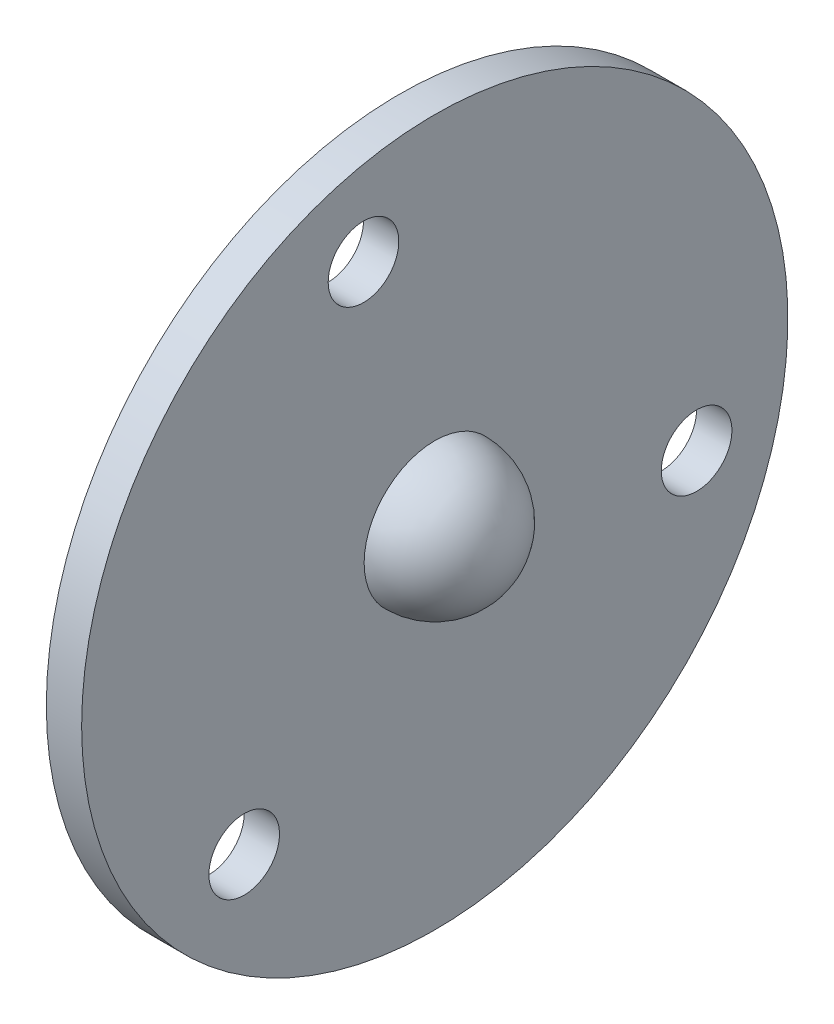
ISO-10303-21;
HEADER;
FILE_DESCRIPTION(('STEP AP214'),'2;1');
FILE_NAME('part.step','',(''),(''),'','','');
FILE_SCHEMA(('AUTOMOTIVE_DESIGN { 1 0 10303 214 1 1 1 1 }'));
ENDSEC;
DATA;
#1=APPLICATION_CONTEXT('core data for automotive mechanical design processes');
#2=APPLICATION_PROTOCOL_DEFINITION('international standard','automotive_design',2000,#1);
#3=PRODUCT_CONTEXT('',#1,'mechanical');
#4=PRODUCT('Part','Part','',(#3));
#5=PRODUCT_RELATED_PRODUCT_CATEGORY('part','',(#4));
#6=PRODUCT_DEFINITION_FORMATION('','',#4);
#7=PRODUCT_DEFINITION_CONTEXT('part definition',#1,'design');
#8=PRODUCT_DEFINITION('design','',#6,#7);
#9=PRODUCT_DEFINITION_SHAPE('','',#8);
#10=(LENGTH_UNIT() NAMED_UNIT(*) SI_UNIT(.MILLI.,.METRE.));
#11=(NAMED_UNIT(*) PLANE_ANGLE_UNIT() SI_UNIT($,.RADIAN.));
#12=(NAMED_UNIT(*) SI_UNIT($,.STERADIAN.) SOLID_ANGLE_UNIT());
#13=UNCERTAINTY_MEASURE_WITH_UNIT(LENGTH_MEASURE(1.E-05),#10,'distance_accuracy_value','');
#14=(GEOMETRIC_REPRESENTATION_CONTEXT(3) GLOBAL_UNCERTAINTY_ASSIGNED_CONTEXT((#13)) GLOBAL_UNIT_ASSIGNED_CONTEXT((#10,
#11,#12)) REPRESENTATION_CONTEXT('',''));
#15=CARTESIAN_POINT('',(0.,0.,0.));
#16=DIRECTION('',(0.,0.,1.));
#17=DIRECTION('',(1.,0.,0.));
#18=AXIS2_PLACEMENT_3D('',#15,#16,#17);
#19=CARTESIAN_POINT('',(-27.1963253808566,0.,0.));
#20=DIRECTION('',(-1.,0.,0.));
#21=DIRECTION('',(0.,0.,-1.));
#22=AXIS2_PLACEMENT_3D('',#19,#20,#21);
#23=SPHERICAL_SURFACE('',#22,11.);
#24=CARTESIAN_POINT('',(-27.1963253808566,0.,0.));
#25=DIRECTION('',(-1.,0.,0.));
#26=DIRECTION('',(0.,0.,1.));
#27=AXIS2_PLACEMENT_3D('',#24,#25,#26);
#28=CIRCLE('',#27,11.);
#29=CARTESIAN_POINT('',(-27.1963253808566,0.,11.));
#30=VERTEX_POINT('',#29);
#31=EDGE_CURVE('E10',#30,#30,#28,.T.);
#32=ORIENTED_EDGE('',*,*,#31,.T.);
#33=EDGE_LOOP('',(#32));
#34=FACE_BOUND('',#33,.T.);
#35=ADVANCED_FACE('F30',(#34),#23,.T.);
#36=CARTESIAN_POINT('',(-27.1963253808566,0.,-30.));
#37=DIRECTION('',(1.,0.,0.));
#38=DIRECTION('',(0.,0.,-1.));
#39=AXIS2_PLACEMENT_3D('',#36,#37,#38);
#40=PLANE('',#39);
#41=CARTESIAN_POINT('',(-27.1963253808566,22.1888707263924,6.05425601436278));
#42=DIRECTION('',(-1.,0.,0.));
#43=DIRECTION('',(0.,-0.866025403784443,-0.499999999999992));
#44=AXIS2_PLACEMENT_3D('',#41,#42,#43);
#45=CIRCLE('',#44,3.);
#46=CARTESIAN_POINT('',(-27.1963253808566,19.590794515039,4.5542560143628));
#47=VERTEX_POINT('',#46);
#48=EDGE_CURVE('E62',#47,#47,#45,.T.);
#49=ORIENTED_EDGE('',*,*,#48,.F.);
#50=EDGE_LOOP('',(#49));
#51=FACE_BOUND('',#50,.T.);
#52=CARTESIAN_POINT('',(-27.1963253808566,-16.3375748726492,16.1889977231632));
#53=DIRECTION('',(-1.,0.,0.));
#54=DIRECTION('',(0.,0.866025403784436,-0.500000000000004));
#55=AXIS2_PLACEMENT_3D('',#52,#53,#54);
#56=CIRCLE('',#55,3.);
#57=CARTESIAN_POINT('',(-27.1963253808566,-13.7394986612958,14.6889977231632));
#58=VERTEX_POINT('',#57);
#59=EDGE_CURVE('E52',#58,#58,#56,.T.);
#60=ORIENTED_EDGE('',*,*,#59,.F.);
#61=EDGE_LOOP('',(#60));
#62=FACE_BOUND('',#61,.T.);
#63=CARTESIAN_POINT('',(-27.1963253808566,-5.85129585374309,-22.2432537375261));
#64=DIRECTION('',(-1.,0.,0.));
#65=DIRECTION('',(0.,0.,1.));
#66=AXIS2_PLACEMENT_3D('',#63,#64,#65);
#67=CIRCLE('',#66,3.);
#68=CARTESIAN_POINT('',(-27.1963253808566,-5.85129585374309,-19.2432537375261));
#69=VERTEX_POINT('',#68);
#70=EDGE_CURVE('E49',#69,#69,#67,.T.);
#71=ORIENTED_EDGE('',*,*,#70,.F.);
#72=EDGE_LOOP('',(#71));
#73=FACE_BOUND('',#72,.T.);
#74=ORIENTED_EDGE('',*,*,#31,.F.);
#75=EDGE_LOOP('',(#74));
#76=FACE_BOUND('',#75,.T.);
#77=CARTESIAN_POINT('',(-27.1963253808566,0.,0.));
#78=DIRECTION('',(-1.,0.,0.));
#79=DIRECTION('',(0.,0.,1.));
#80=AXIS2_PLACEMENT_3D('',#77,#78,#79);
#81=CIRCLE('',#80,30.);
#82=CARTESIAN_POINT('',(-27.1963253808566,0.,30.));
#83=VERTEX_POINT('',#82);
#84=EDGE_CURVE('E37',#83,#83,#81,.T.);
#85=ORIENTED_EDGE('',*,*,#84,.T.);
#86=EDGE_LOOP('',(#85));
#87=FACE_BOUND('',#86,.T.);
#88=ADVANCED_FACE('F89',(#51,#62,#73,#76,#87),#40,.F.);
#89=CARTESIAN_POINT('',(-57.6693164702501,0.,0.));
#90=DIRECTION('',(-1.,0.,0.));
#91=DIRECTION('',(0.,0.,1.));
#92=AXIS2_PLACEMENT_3D('',#89,#90,#91);
#93=CYLINDRICAL_SURFACE('',#92,30.);
#94=ORIENTED_EDGE('',*,*,#84,.F.);
#95=EDGE_LOOP('',(#94));
#96=FACE_BOUND('',#95,.T.);
#97=CARTESIAN_POINT('',(-24.1963253808566,0.,0.));
#98=DIRECTION('',(-1.,0.,0.));
#99=DIRECTION('',(0.,0.,1.));
#100=AXIS2_PLACEMENT_3D('',#97,#98,#99);
#101=CIRCLE('',#100,30.);
#102=CARTESIAN_POINT('',(-24.1963253808566,0.,30.));
#103=VERTEX_POINT('',#102);
#104=EDGE_CURVE('E42',#103,#103,#101,.T.);
#105=ORIENTED_EDGE('',*,*,#104,.T.);
#106=EDGE_LOOP('',(#105));
#107=FACE_BOUND('',#106,.T.);
#108=ADVANCED_FACE('F69',(#96,#107),#93,.T.);
#109=CARTESIAN_POINT('',(-24.1963253808566,0.,-6.));
#110=DIRECTION('',(-1.,0.,0.));
#111=DIRECTION('',(0.,0.,1.));
#112=AXIS2_PLACEMENT_3D('',#109,#110,#111);
#113=PLANE('',#112);
#114=CARTESIAN_POINT('',(-24.1963253808566,22.1888707263924,6.05425601436278));
#115=DIRECTION('',(-1.,0.,0.));
#116=DIRECTION('',(0.,0.,1.));
#117=AXIS2_PLACEMENT_3D('',#114,#115,#116);
#118=CIRCLE('',#117,3.);
#119=CARTESIAN_POINT('',(-24.1963253808566,22.1888707263924,9.05425601436277));
#120=VERTEX_POINT('',#119);
#121=EDGE_CURVE('E33',#120,#120,#118,.T.);
#122=ORIENTED_EDGE('',*,*,#121,.T.);
#123=EDGE_LOOP('',(#122));
#124=FACE_BOUND('',#123,.T.);
#125=CARTESIAN_POINT('',(-24.1963253808566,-16.3375748726492,16.1889977231632));
#126=DIRECTION('',(-1.,0.,0.));
#127=DIRECTION('',(0.,0.,1.));
#128=AXIS2_PLACEMENT_3D('',#125,#126,#127);
#129=CIRCLE('',#128,3.);
#130=CARTESIAN_POINT('',(-24.1963253808566,-16.3375748726492,19.1889977231632));
#131=VERTEX_POINT('',#130);
#132=EDGE_CURVE('E50',#131,#131,#129,.T.);
#133=ORIENTED_EDGE('',*,*,#132,.T.);
#134=EDGE_LOOP('',(#133));
#135=FACE_BOUND('',#134,.T.);
#136=CARTESIAN_POINT('',(-24.1963253808566,-5.85129585374309,-22.2432537375261));
#137=DIRECTION('',(-1.,0.,0.));
#138=DIRECTION('',(0.,0.,1.));
#139=AXIS2_PLACEMENT_3D('',#136,#137,#138);
#140=CIRCLE('',#139,3.);
#141=CARTESIAN_POINT('',(-24.1963253808566,-5.85129585374309,-19.2432537375261));
#142=VERTEX_POINT('',#141);
#143=EDGE_CURVE('E46',#142,#142,#140,.T.);
#144=ORIENTED_EDGE('',*,*,#143,.T.);
#145=EDGE_LOOP('',(#144));
#146=FACE_BOUND('',#145,.T.);
#147=ORIENTED_EDGE('',*,*,#104,.F.);
#148=EDGE_LOOP('',(#147));
#149=FACE_BOUND('',#148,.T.);
#150=CARTESIAN_POINT('',(-24.1963253808566,0.,0.));
#151=DIRECTION('',(-1.,0.,0.));
#152=DIRECTION('',(0.,0.,1.));
#153=AXIS2_PLACEMENT_3D('',#150,#151,#152);
#154=CIRCLE('',#153,6.);
#155=CARTESIAN_POINT('',(-24.1963253808566,0.,6.));
#156=VERTEX_POINT('',#155);
#157=EDGE_CURVE('E48',#156,#156,#154,.T.);
#158=ORIENTED_EDGE('',*,*,#157,.T.);
#159=EDGE_LOOP('',(#158));
#160=FACE_BOUND('',#159,.T.);
#161=ADVANCED_FACE('F71',(#124,#135,#146,#149,#160),#113,.F.);
#162=CARTESIAN_POINT('',(-24.1963253808566,0.,0.));
#163=DIRECTION('',(-1.,0.,0.));
#164=DIRECTION('',(0.,0.,-1.));
#165=AXIS2_PLACEMENT_3D('',#162,#163,#164);
#166=SPHERICAL_SURFACE('',#165,6.);
#167=ORIENTED_EDGE('',*,*,#157,.F.);
#168=EDGE_LOOP('',(#167));
#169=FACE_BOUND('',#168,.T.);
#170=ADVANCED_FACE('F74',(#169),#166,.T.);
#171=CARTESIAN_POINT('',(-17.1963253808566,-5.85129585374309,-22.2432537375261));
#172=DIRECTION('',(-1.,0.,0.));
#173=DIRECTION('',(0.,0.,1.));
#174=AXIS2_PLACEMENT_3D('',#171,#172,#173);
#175=CYLINDRICAL_SURFACE('',#174,3.);
#176=ORIENTED_EDGE('',*,*,#70,.T.);
#177=EDGE_LOOP('',(#176));
#178=FACE_BOUND('',#177,.T.);
#179=ORIENTED_EDGE('',*,*,#143,.F.);
#180=EDGE_LOOP('',(#179));
#181=FACE_BOUND('',#180,.T.);
#182=ADVANCED_FACE('F80',(#178,#181),#175,.F.);
#183=CARTESIAN_POINT('',(-17.1963253808566,-16.3375748726492,16.1889977231632));
#184=DIRECTION('',(-1.,0.,0.));
#185=DIRECTION('',(0.,0.,1.));
#186=AXIS2_PLACEMENT_3D('',#183,#184,#185);
#187=CYLINDRICAL_SURFACE('',#186,3.);
#188=ORIENTED_EDGE('',*,*,#59,.T.);
#189=EDGE_LOOP('',(#188));
#190=FACE_BOUND('',#189,.T.);
#191=ORIENTED_EDGE('',*,*,#132,.F.);
#192=EDGE_LOOP('',(#191));
#193=FACE_BOUND('',#192,.T.);
#194=ADVANCED_FACE('F85',(#190,#193),#187,.F.);
#195=CARTESIAN_POINT('',(-17.1963253808566,22.1888707263924,6.05425601436278));
#196=DIRECTION('',(-1.,0.,0.));
#197=DIRECTION('',(0.,0.,1.));
#198=AXIS2_PLACEMENT_3D('',#195,#196,#197);
#199=CYLINDRICAL_SURFACE('',#198,3.);
#200=ORIENTED_EDGE('',*,*,#48,.T.);
#201=EDGE_LOOP('',(#200));
#202=FACE_BOUND('',#201,.T.);
#203=ORIENTED_EDGE('',*,*,#121,.F.);
#204=EDGE_LOOP('',(#203));
#205=FACE_BOUND('',#204,.T.);
#206=ADVANCED_FACE('F111',(#202,#205),#199,.F.);
#207=CLOSED_SHELL('',(#35,#88,#108,#161,#170,#182,#194,#206));
#208=MANIFOLD_SOLID_BREP('B2',#207);
#209=ADVANCED_BREP_SHAPE_REPRESENTATION('',(#18,#208),#14);
#210=SHAPE_DEFINITION_REPRESENTATION(#9,#209);
ENDSEC;
END-ISO-10303-21;
